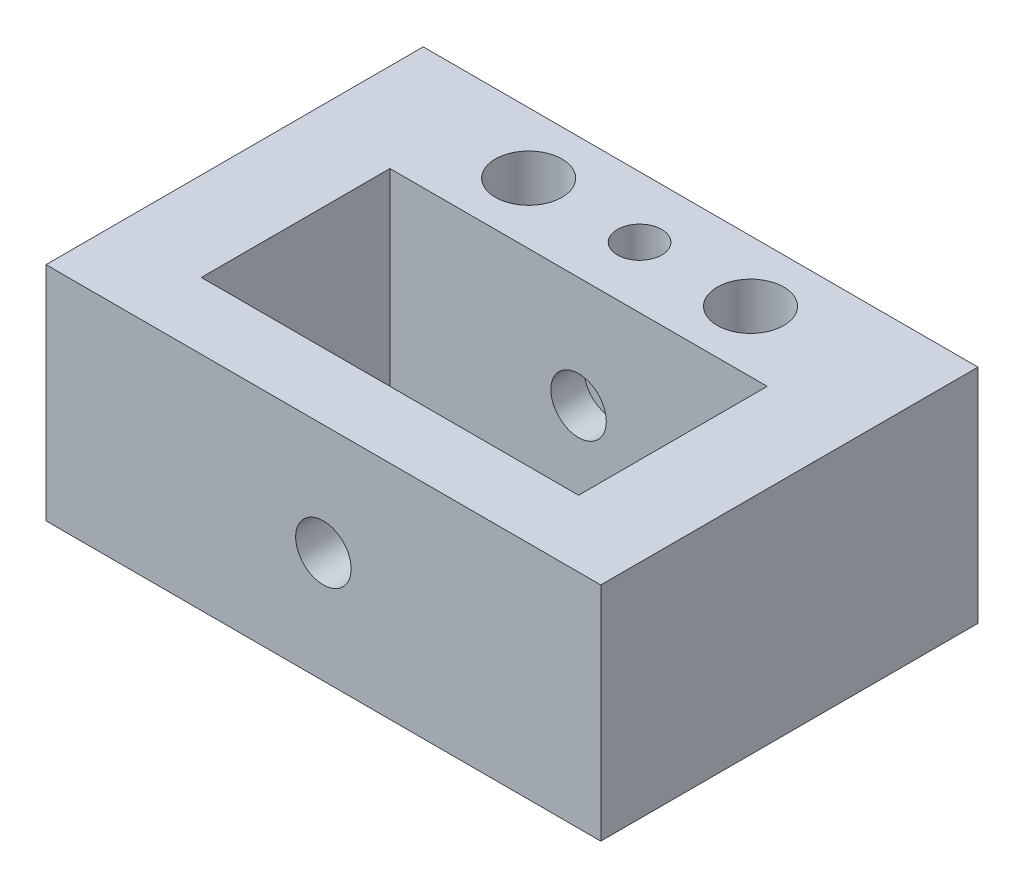
ISO-10303-21;
HEADER;
FILE_DESCRIPTION(('STEP AP214'),'2;1');
FILE_NAME('part.step','',(''),(''),'','','');
FILE_SCHEMA(('AUTOMOTIVE_DESIGN { 1 0 10303 214 1 1 1 1 }'));
ENDSEC;
DATA;
#1=APPLICATION_CONTEXT('core data for automotive mechanical design processes');
#2=APPLICATION_PROTOCOL_DEFINITION('international standard','automotive_design',2000,#1);
#3=PRODUCT_CONTEXT('',#1,'mechanical');
#4=PRODUCT('Part','Part','',(#3));
#5=PRODUCT_RELATED_PRODUCT_CATEGORY('part','',(#4));
#6=PRODUCT_DEFINITION_FORMATION('','',#4);
#7=PRODUCT_DEFINITION_CONTEXT('part definition',#1,'design');
#8=PRODUCT_DEFINITION('design','',#6,#7);
#9=PRODUCT_DEFINITION_SHAPE('','',#8);
#10=(LENGTH_UNIT() NAMED_UNIT(*) SI_UNIT(.MILLI.,.METRE.));
#11=(NAMED_UNIT(*) PLANE_ANGLE_UNIT() SI_UNIT($,.RADIAN.));
#12=(NAMED_UNIT(*) SI_UNIT($,.STERADIAN.) SOLID_ANGLE_UNIT());
#13=UNCERTAINTY_MEASURE_WITH_UNIT(LENGTH_MEASURE(1.E-05),#10,'distance_accuracy_value','');
#14=(GEOMETRIC_REPRESENTATION_CONTEXT(3) GLOBAL_UNCERTAINTY_ASSIGNED_CONTEXT((#13)) GLOBAL_UNIT_ASSIGNED_CONTEXT((#10,
#11,#12)) REPRESENTATION_CONTEXT('',''));
#15=CARTESIAN_POINT('',(0.,0.,0.));
#16=DIRECTION('',(0.,0.,1.));
#17=DIRECTION('',(1.,0.,0.));
#18=AXIS2_PLACEMENT_3D('',#15,#16,#17);
#19=CARTESIAN_POINT('',(17.,10.,33.));
#20=DIRECTION('',(1.,0.,0.));
#21=DIRECTION('',(0.,0.,-1.));
#22=AXIS2_PLACEMENT_3D('',#19,#20,#21);
#23=PLANE('',#22);
#24=DIRECTION('',(0.,-1.,0.));
#25=VECTOR('',#24,1.);
#26=CARTESIAN_POINT('',(17.,10.,28.));
#27=LINE('',#26,#25);
#28=CARTESIAN_POINT('',(17.,10.,28.));
#29=VERTEX_POINT('',#28);
#30=CARTESIAN_POINT('',(17.,-10.,28.));
#31=VERTEX_POINT('',#30);
#32=EDGE_CURVE('E55',#29,#31,#27,.T.);
#33=ORIENTED_EDGE('',*,*,#32,.F.);
#34=DIRECTION('',(0.,0.,-1.));
#35=VECTOR('',#34,1.);
#36=CARTESIAN_POINT('',(17.,10.,33.));
#37=LINE('',#36,#35);
#38=CARTESIAN_POINT('',(17.,10.,11.));
#39=VERTEX_POINT('',#38);
#40=EDGE_CURVE('E167',#29,#39,#37,.T.);
#41=ORIENTED_EDGE('',*,*,#40,.T.);
#42=DIRECTION('',(0.,-1.,0.));
#43=VECTOR('',#42,1.);
#44=CARTESIAN_POINT('',(17.,10.,11.));
#45=LINE('',#44,#43);
#46=CARTESIAN_POINT('',(17.,-10.,11.));
#47=VERTEX_POINT('',#46);
#48=EDGE_CURVE('E160',#39,#47,#45,.T.);
#49=ORIENTED_EDGE('',*,*,#48,.T.);
#50=DIRECTION('',(0.,0.,-1.));
#51=VECTOR('',#50,1.);
#52=CARTESIAN_POINT('',(17.,-10.,33.));
#53=LINE('',#52,#51);
#54=EDGE_CURVE('E164',#31,#47,#53,.T.);
#55=ORIENTED_EDGE('',*,*,#54,.F.);
#56=EDGE_LOOP('',(#33,#41,#49,#55));
#57=FACE_BOUND('',#56,.T.);
#58=ADVANCED_FACE('F39',(#57),#23,.F.);
#59=CARTESIAN_POINT('',(-17.,10.,33.));
#60=DIRECTION('',(-1.,0.,0.));
#61=DIRECTION('',(0.,0.,1.));
#62=AXIS2_PLACEMENT_3D('',#59,#60,#61);
#63=PLANE('',#62);
#64=DIRECTION('',(0.,1.,0.));
#65=VECTOR('',#64,1.);
#66=CARTESIAN_POINT('',(-17.,10.,28.));
#67=LINE('',#66,#65);
#68=CARTESIAN_POINT('',(-17.,-10.,28.));
#69=VERTEX_POINT('',#68);
#70=CARTESIAN_POINT('',(-17.,10.,28.));
#71=VERTEX_POINT('',#70);
#72=EDGE_CURVE('E11',#69,#71,#67,.T.);
#73=ORIENTED_EDGE('',*,*,#72,.F.);
#74=DIRECTION('',(0.,0.,-1.));
#75=VECTOR('',#74,1.);
#76=CARTESIAN_POINT('',(-17.,-10.,33.));
#77=LINE('',#76,#75);
#78=CARTESIAN_POINT('',(-17.,-10.,11.));
#79=VERTEX_POINT('',#78);
#80=EDGE_CURVE('E157',#69,#79,#77,.T.);
#81=ORIENTED_EDGE('',*,*,#80,.T.);
#82=DIRECTION('',(0.,1.,0.));
#83=VECTOR('',#82,1.);
#84=CARTESIAN_POINT('',(-17.,10.,11.));
#85=LINE('',#84,#83);
#86=CARTESIAN_POINT('',(-17.,10.,11.));
#87=VERTEX_POINT('',#86);
#88=EDGE_CURVE('E147',#79,#87,#85,.T.);
#89=ORIENTED_EDGE('',*,*,#88,.T.);
#90=DIRECTION('',(0.,0.,-1.));
#91=VECTOR('',#90,1.);
#92=CARTESIAN_POINT('',(-17.,10.,33.));
#93=LINE('',#92,#91);
#94=EDGE_CURVE('E154',#71,#87,#93,.T.);
#95=ORIENTED_EDGE('',*,*,#94,.F.);
#96=EDGE_LOOP('',(#73,#81,#89,#95));
#97=FACE_BOUND('',#96,.T.);
#98=ADVANCED_FACE('F266',(#97),#63,.F.);
#99=CARTESIAN_POINT('',(0.,0.,11.));
#100=DIRECTION('',(0.,0.,-1.));
#101=DIRECTION('',(-1.,0.,0.));
#102=AXIS2_PLACEMENT_3D('',#99,#100,#101);
#103=PLANE('',#102);
#104=CARTESIAN_POINT('',(0.,0.,11.));
#105=DIRECTION('',(0.,0.,1.));
#106=DIRECTION('',(1.,0.,0.));
#107=AXIS2_PLACEMENT_3D('',#104,#105,#106);
#108=CIRCLE('',#107,2.5);
#109=CARTESIAN_POINT('',(2.5,0.,11.));
#110=VERTEX_POINT('',#109);
#111=EDGE_CURVE('E142',#110,#110,#108,.T.);
#112=ORIENTED_EDGE('',*,*,#111,.F.);
#113=EDGE_LOOP('',(#112));
#114=FACE_BOUND('',#113,.T.);
#115=ORIENTED_EDGE('',*,*,#88,.F.);
#116=DIRECTION('',(1.,0.,0.));
#117=VECTOR('',#116,1.);
#118=CARTESIAN_POINT('',(-25.,-10.,11.));
#119=LINE('',#118,#117);
#120=EDGE_CURVE('E206',#79,#47,#119,.T.);
#121=ORIENTED_EDGE('',*,*,#120,.T.);
#122=ORIENTED_EDGE('',*,*,#48,.F.);
#123=DIRECTION('',(-1.,0.,0.));
#124=VECTOR('',#123,1.);
#125=CARTESIAN_POINT('',(-25.,10.,11.));
#126=LINE('',#125,#124);
#127=EDGE_CURVE('E202',#39,#87,#126,.T.);
#128=ORIENTED_EDGE('',*,*,#127,.T.);
#129=EDGE_LOOP('',(#115,#121,#122,#128));
#130=FACE_BOUND('',#129,.T.);
#131=ADVANCED_FACE('F271',(#114,#130),#103,.F.);
#132=CARTESIAN_POINT('',(25.,-10.,11.));
#133=DIRECTION('',(-1.,0.,0.));
#134=DIRECTION('',(0.,0.,1.));
#135=AXIS2_PLACEMENT_3D('',#132,#133,#134);
#136=PLANE('',#135);
#137=DIRECTION('',(0.,0.,-1.));
#138=VECTOR('',#137,1.);
#139=CARTESIAN_POINT('',(25.,-10.,11.));
#140=LINE('',#139,#138);
#141=CARTESIAN_POINT('',(25.,-10.,34.));
#142=VERTEX_POINT('',#141);
#143=CARTESIAN_POINT('',(25.,-10.,0.));
#144=VERTEX_POINT('',#143);
#145=EDGE_CURVE('E211',#142,#144,#140,.T.);
#146=ORIENTED_EDGE('',*,*,#145,.T.);
#147=DIRECTION('',(0.,1.,0.));
#148=VECTOR('',#147,1.);
#149=CARTESIAN_POINT('',(25.,-10.,0.));
#150=LINE('',#149,#148);
#151=CARTESIAN_POINT('',(25.,10.,0.));
#152=VERTEX_POINT('',#151);
#153=EDGE_CURVE('E107',#144,#152,#150,.T.);
#154=ORIENTED_EDGE('',*,*,#153,.T.);
#155=DIRECTION('',(0.,0.,-1.));
#156=VECTOR('',#155,1.);
#157=CARTESIAN_POINT('',(25.,10.,11.));
#158=LINE('',#157,#156);
#159=CARTESIAN_POINT('',(25.,10.,34.));
#160=VERTEX_POINT('',#159);
#161=EDGE_CURVE('E48',#160,#152,#158,.T.);
#162=ORIENTED_EDGE('',*,*,#161,.F.);
#163=DIRECTION('',(0.,1.,0.));
#164=VECTOR('',#163,1.);
#165=CARTESIAN_POINT('',(25.,-10.,34.));
#166=LINE('',#165,#164);
#167=EDGE_CURVE('E105',#142,#160,#166,.T.);
#168=ORIENTED_EDGE('',*,*,#167,.F.);
#169=EDGE_LOOP('',(#146,#154,#162,#168));
#170=FACE_BOUND('',#169,.T.);
#171=ADVANCED_FACE('F41',(#170),#136,.F.);
#172=CARTESIAN_POINT('',(-25.,10.,11.));
#173=DIRECTION('',(0.,-1.,0.));
#174=DIRECTION('',(0.,0.,-1.));
#175=AXIS2_PLACEMENT_3D('',#172,#173,#174);
#176=PLANE('',#175);
#177=ORIENTED_EDGE('',*,*,#40,.F.);
#178=DIRECTION('',(-1.,0.,0.));
#179=VECTOR('',#178,1.);
#180=CARTESIAN_POINT('',(25.,10.,28.));
#181=LINE('',#180,#179);
#182=EDGE_CURVE('E132',#29,#71,#181,.T.);
#183=ORIENTED_EDGE('',*,*,#182,.T.);
#184=ORIENTED_EDGE('',*,*,#94,.T.);
#185=ORIENTED_EDGE('',*,*,#127,.F.);
#186=EDGE_LOOP('',(#177,#183,#184,#185));
#187=FACE_BOUND('',#186,.T.);
#188=ORIENTED_EDGE('',*,*,#161,.T.);
#189=DIRECTION('',(-1.,0.,0.));
#190=VECTOR('',#189,1.);
#191=CARTESIAN_POINT('',(-25.,10.,0.));
#192=LINE('',#191,#190);
#193=CARTESIAN_POINT('',(-25.,10.,0.));
#194=VERTEX_POINT('',#193);
#195=EDGE_CURVE('E214',#152,#194,#192,.T.);
#196=ORIENTED_EDGE('',*,*,#195,.T.);
#197=DIRECTION('',(0.,0.,-1.));
#198=VECTOR('',#197,1.);
#199=CARTESIAN_POINT('',(-25.,10.,11.));
#200=LINE('',#199,#198);
#201=CARTESIAN_POINT('',(-25.,10.,34.));
#202=VERTEX_POINT('',#201);
#203=EDGE_CURVE('E112',#202,#194,#200,.T.);
#204=ORIENTED_EDGE('',*,*,#203,.F.);
#205=DIRECTION('',(-1.,0.,0.));
#206=VECTOR('',#205,1.);
#207=CARTESIAN_POINT('',(25.,10.,34.));
#208=LINE('',#207,#206);
#209=EDGE_CURVE('E114',#160,#202,#208,.T.);
#210=ORIENTED_EDGE('',*,*,#209,.F.);
#211=EDGE_LOOP('',(#188,#196,#204,#210));
#212=FACE_BOUND('',#211,.T.);
#213=CARTESIAN_POINT('',(-10.,10.,5.5));
#214=DIRECTION('',(0.,-1.,0.));
#215=DIRECTION('',(0.,0.,-1.));
#216=AXIS2_PLACEMENT_3D('',#213,#214,#215);
#217=CIRCLE('',#216,3.);
#218=CARTESIAN_POINT('',(-10.,10.,2.5));
#219=VERTEX_POINT('',#218);
#220=EDGE_CURVE('E171',#219,#219,#217,.T.);
#221=ORIENTED_EDGE('',*,*,#220,.T.);
#222=EDGE_LOOP('',(#221));
#223=FACE_BOUND('',#222,.T.);
#224=CARTESIAN_POINT('',(10.,10.,5.49999999999998));
#225=DIRECTION('',(0.,-1.,0.));
#226=DIRECTION('',(0.,0.,1.));
#227=AXIS2_PLACEMENT_3D('',#224,#225,#226);
#228=CIRCLE('',#227,3.);
#229=CARTESIAN_POINT('',(10.,10.,8.49999999999998));
#230=VERTEX_POINT('',#229);
#231=EDGE_CURVE('E180',#230,#230,#228,.T.);
#232=ORIENTED_EDGE('',*,*,#231,.T.);
#233=EDGE_LOOP('',(#232));
#234=FACE_BOUND('',#233,.T.);
#235=CARTESIAN_POINT('',(0.,10.,5.5));
#236=DIRECTION('',(0.,-1.,0.));
#237=DIRECTION('',(0.,0.,-1.));
#238=AXIS2_PLACEMENT_3D('',#235,#236,#237);
#239=CIRCLE('',#238,2.);
#240=CARTESIAN_POINT('',(0.,10.,3.5));
#241=VERTEX_POINT('',#240);
#242=EDGE_CURVE('E187',#241,#241,#239,.T.);
#243=ORIENTED_EDGE('',*,*,#242,.T.);
#244=EDGE_LOOP('',(#243));
#245=FACE_BOUND('',#244,.T.);
#246=ADVANCED_FACE('F115',(#187,#212,#223,#234,#245),#176,.F.);
#247=CARTESIAN_POINT('',(-25.,-10.,11.));
#248=DIRECTION('',(1.,0.,0.));
#249=DIRECTION('',(0.,0.,-1.));
#250=AXIS2_PLACEMENT_3D('',#247,#248,#249);
#251=PLANE('',#250);
#252=ORIENTED_EDGE('',*,*,#203,.T.);
#253=DIRECTION('',(0.,-1.,0.));
#254=VECTOR('',#253,1.);
#255=CARTESIAN_POINT('',(-25.,-10.,0.));
#256=LINE('',#255,#254);
#257=CARTESIAN_POINT('',(-25.,-10.,0.));
#258=VERTEX_POINT('',#257);
#259=EDGE_CURVE('E217',#194,#258,#256,.T.);
#260=ORIENTED_EDGE('',*,*,#259,.T.);
#261=DIRECTION('',(0.,0.,-1.));
#262=VECTOR('',#261,1.);
#263=CARTESIAN_POINT('',(-25.,-10.,11.));
#264=LINE('',#263,#262);
#265=CARTESIAN_POINT('',(-25.,-10.,34.));
#266=VERTEX_POINT('',#265);
#267=EDGE_CURVE('E226',#266,#258,#264,.T.);
#268=ORIENTED_EDGE('',*,*,#267,.F.);
#269=DIRECTION('',(0.,-1.,0.));
#270=VECTOR('',#269,1.);
#271=CARTESIAN_POINT('',(-25.,10.,34.));
#272=LINE('',#271,#270);
#273=EDGE_CURVE('E121',#202,#266,#272,.T.);
#274=ORIENTED_EDGE('',*,*,#273,.F.);
#275=EDGE_LOOP('',(#252,#260,#268,#274));
#276=FACE_BOUND('',#275,.T.);
#277=ADVANCED_FACE('F231',(#276),#251,.F.);
#278=CARTESIAN_POINT('',(-25.,-10.,11.));
#279=DIRECTION('',(0.,1.,0.));
#280=DIRECTION('',(0.,0.,1.));
#281=AXIS2_PLACEMENT_3D('',#278,#279,#280);
#282=PLANE('',#281);
#283=ORIENTED_EDGE('',*,*,#80,.F.);
#284=DIRECTION('',(1.,0.,0.));
#285=VECTOR('',#284,1.);
#286=CARTESIAN_POINT('',(-25.,-10.,28.));
#287=LINE('',#286,#285);
#288=EDGE_CURVE('E128',#69,#31,#287,.T.);
#289=ORIENTED_EDGE('',*,*,#288,.T.);
#290=ORIENTED_EDGE('',*,*,#54,.T.);
#291=ORIENTED_EDGE('',*,*,#120,.F.);
#292=EDGE_LOOP('',(#283,#289,#290,#291));
#293=FACE_BOUND('',#292,.T.);
#294=ORIENTED_EDGE('',*,*,#145,.F.);
#295=DIRECTION('',(1.,0.,0.));
#296=VECTOR('',#295,1.);
#297=CARTESIAN_POINT('',(-25.,-10.,34.));
#298=LINE('',#297,#296);
#299=EDGE_CURVE('E126',#266,#142,#298,.T.);
#300=ORIENTED_EDGE('',*,*,#299,.F.);
#301=ORIENTED_EDGE('',*,*,#267,.T.);
#302=DIRECTION('',(1.,0.,0.));
#303=VECTOR('',#302,1.);
#304=CARTESIAN_POINT('',(-25.,-10.,0.));
#305=LINE('',#304,#303);
#306=EDGE_CURVE('E207',#258,#144,#305,.T.);
#307=ORIENTED_EDGE('',*,*,#306,.T.);
#308=EDGE_LOOP('',(#294,#300,#301,#307));
#309=FACE_BOUND('',#308,.T.);
#310=CARTESIAN_POINT('',(-10.,-10.,5.5));
#311=DIRECTION('',(0.,-1.,0.));
#312=DIRECTION('',(0.,0.,-1.));
#313=AXIS2_PLACEMENT_3D('',#310,#311,#312);
#314=CIRCLE('',#313,3.);
#315=CARTESIAN_POINT('',(-10.,-10.,2.5));
#316=VERTEX_POINT('',#315);
#317=EDGE_CURVE('E176',#316,#316,#314,.T.);
#318=ORIENTED_EDGE('',*,*,#317,.F.);
#319=EDGE_LOOP('',(#318));
#320=FACE_BOUND('',#319,.T.);
#321=CARTESIAN_POINT('',(10.,-10.,5.49999999999998));
#322=DIRECTION('',(0.,-1.,0.));
#323=DIRECTION('',(0.,0.,1.));
#324=AXIS2_PLACEMENT_3D('',#321,#322,#323);
#325=CIRCLE('',#324,3.);
#326=CARTESIAN_POINT('',(10.,-10.,8.49999999999998));
#327=VERTEX_POINT('',#326);
#328=EDGE_CURVE('E170',#327,#327,#325,.T.);
#329=ORIENTED_EDGE('',*,*,#328,.F.);
#330=EDGE_LOOP('',(#329));
#331=FACE_BOUND('',#330,.T.);
#332=CARTESIAN_POINT('',(0.,-10.,5.5));
#333=DIRECTION('',(0.,-1.,0.));
#334=DIRECTION('',(0.,0.,-1.));
#335=AXIS2_PLACEMENT_3D('',#332,#333,#334);
#336=CIRCLE('',#335,2.);
#337=CARTESIAN_POINT('',(0.,-10.,3.5));
#338=VERTEX_POINT('',#337);
#339=EDGE_CURVE('E175',#338,#338,#336,.T.);
#340=ORIENTED_EDGE('',*,*,#339,.F.);
#341=EDGE_LOOP('',(#340));
#342=FACE_BOUND('',#341,.T.);
#343=ADVANCED_FACE('F237',(#293,#309,#320,#331,#342),#282,.F.);
#344=CARTESIAN_POINT('',(0.,0.,0.));
#345=DIRECTION('',(0.,0.,-1.));
#346=DIRECTION('',(-1.,0.,0.));
#347=AXIS2_PLACEMENT_3D('',#344,#345,#346);
#348=PLANE('',#347);
#349=CARTESIAN_POINT('',(20.,0.,0.));
#350=DIRECTION('',(0.,0.,-1.));
#351=DIRECTION('',(-1.,0.,0.));
#352=AXIS2_PLACEMENT_3D('',#349,#350,#351);
#353=CIRCLE('',#352,2.);
#354=CARTESIAN_POINT('',(18.,0.,0.));
#355=VERTEX_POINT('',#354);
#356=EDGE_CURVE('E195',#355,#355,#353,.T.);
#357=ORIENTED_EDGE('',*,*,#356,.F.);
#358=EDGE_LOOP('',(#357));
#359=FACE_BOUND('',#358,.T.);
#360=CARTESIAN_POINT('',(-20.,0.,0.));
#361=DIRECTION('',(0.,0.,-1.));
#362=DIRECTION('',(-1.,0.,0.));
#363=AXIS2_PLACEMENT_3D('',#360,#361,#362);
#364=CIRCLE('',#363,2.);
#365=CARTESIAN_POINT('',(-22.,0.,0.));
#366=VERTEX_POINT('',#365);
#367=EDGE_CURVE('E191',#366,#366,#364,.T.);
#368=ORIENTED_EDGE('',*,*,#367,.F.);
#369=EDGE_LOOP('',(#368));
#370=FACE_BOUND('',#369,.T.);
#371=ORIENTED_EDGE('',*,*,#153,.F.);
#372=ORIENTED_EDGE('',*,*,#306,.F.);
#373=ORIENTED_EDGE('',*,*,#259,.F.);
#374=ORIENTED_EDGE('',*,*,#195,.F.);
#375=EDGE_LOOP('',(#371,#372,#373,#374));
#376=FACE_BOUND('',#375,.T.);
#377=ADVANCED_FACE('F235',(#359,#370,#376),#348,.T.);
#378=CARTESIAN_POINT('',(-20.,0.,16.6568542494924));
#379=DIRECTION('',(0.,0.,-1.));
#380=DIRECTION('',(-1.,0.,0.));
#381=AXIS2_PLACEMENT_3D('',#378,#379,#380);
#382=CYLINDRICAL_SURFACE('',#381,2.);
#383=ORIENTED_EDGE('',*,*,#367,.T.);
#384=EDGE_LOOP('',(#383));
#385=FACE_BOUND('',#384,.T.);
#386=CARTESIAN_POINT('',(-20.,0.,24.));
#387=DIRECTION('',(0.,0.,-1.));
#388=DIRECTION('',(-1.,0.,0.));
#389=AXIS2_PLACEMENT_3D('',#386,#387,#388);
#390=CIRCLE('',#389,2.);
#391=CARTESIAN_POINT('',(-22.,0.,24.));
#392=VERTEX_POINT('',#391);
#393=EDGE_CURVE('E311',#392,#392,#390,.T.);
#394=ORIENTED_EDGE('',*,*,#393,.F.);
#395=EDGE_LOOP('',(#394));
#396=FACE_BOUND('',#395,.T.);
#397=ADVANCED_FACE('F261',(#385,#396),#382,.F.);
#398=CARTESIAN_POINT('',(20.,0.,16.6568542494924));
#399=DIRECTION('',(0.,0.,-1.));
#400=DIRECTION('',(-1.,0.,0.));
#401=AXIS2_PLACEMENT_3D('',#398,#399,#400);
#402=CYLINDRICAL_SURFACE('',#401,2.);
#403=ORIENTED_EDGE('',*,*,#356,.T.);
#404=EDGE_LOOP('',(#403));
#405=FACE_BOUND('',#404,.T.);
#406=CARTESIAN_POINT('',(20.,0.,24.));
#407=DIRECTION('',(0.,0.,-1.));
#408=DIRECTION('',(-1.,0.,0.));
#409=AXIS2_PLACEMENT_3D('',#406,#407,#408);
#410=CIRCLE('',#409,2.);
#411=CARTESIAN_POINT('',(18.,0.,24.));
#412=VERTEX_POINT('',#411);
#413=EDGE_CURVE('E314',#412,#412,#410,.T.);
#414=ORIENTED_EDGE('',*,*,#413,.F.);
#415=EDGE_LOOP('',(#414));
#416=FACE_BOUND('',#415,.T.);
#417=ADVANCED_FACE('F251',(#405,#416),#402,.F.);
#418=CARTESIAN_POINT('',(0.,10.,5.5));
#419=DIRECTION('',(0.,-1.,0.));
#420=DIRECTION('',(0.,0.,-1.));
#421=AXIS2_PLACEMENT_3D('',#418,#419,#420);
#422=CYLINDRICAL_SURFACE('',#421,2.);
#423=ORIENTED_EDGE('',*,*,#242,.F.);
#424=EDGE_LOOP('',(#423));
#425=FACE_BOUND('',#424,.T.);
#426=ORIENTED_EDGE('',*,*,#339,.T.);
#427=EDGE_LOOP('',(#426));
#428=FACE_BOUND('',#427,.T.);
#429=ADVANCED_FACE('F248',(#425,#428),#422,.F.);
#430=CARTESIAN_POINT('',(10.,10.,5.49999999999998));
#431=DIRECTION('',(0.,-1.,0.));
#432=DIRECTION('',(0.,0.,-1.));
#433=AXIS2_PLACEMENT_3D('',#430,#431,#432);
#434=CYLINDRICAL_SURFACE('',#433,3.);
#435=ORIENTED_EDGE('',*,*,#231,.F.);
#436=EDGE_LOOP('',(#435));
#437=FACE_BOUND('',#436,.T.);
#438=ORIENTED_EDGE('',*,*,#328,.T.);
#439=EDGE_LOOP('',(#438));
#440=FACE_BOUND('',#439,.T.);
#441=ADVANCED_FACE('F250',(#437,#440),#434,.F.);
#442=CARTESIAN_POINT('',(-10.,10.,5.5));
#443=DIRECTION('',(0.,-1.,0.));
#444=DIRECTION('',(0.,0.,-1.));
#445=AXIS2_PLACEMENT_3D('',#442,#443,#444);
#446=CYLINDRICAL_SURFACE('',#445,3.);
#447=ORIENTED_EDGE('',*,*,#220,.F.);
#448=EDGE_LOOP('',(#447));
#449=FACE_BOUND('',#448,.T.);
#450=ORIENTED_EDGE('',*,*,#317,.T.);
#451=EDGE_LOOP('',(#450));
#452=FACE_BOUND('',#451,.T.);
#453=ADVANCED_FACE('F258',(#449,#452),#446,.F.);
#454=CARTESIAN_POINT('',(0.,0.,8.));
#455=DIRECTION('',(0.,0.,1.));
#456=DIRECTION('',(1.,0.,0.));
#457=AXIS2_PLACEMENT_3D('',#454,#455,#456);
#458=CYLINDRICAL_SURFACE('',#457,2.5);
#459=CARTESIAN_POINT('',(0.,0.,8.));
#460=DIRECTION('',(0.,0.,1.));
#461=DIRECTION('',(1.,0.,0.));
#462=AXIS2_PLACEMENT_3D('',#459,#460,#461);
#463=CIRCLE('',#462,2.5);
#464=CARTESIAN_POINT('',(2.5,0.,8.));
#465=VERTEX_POINT('',#464);
#466=EDGE_CURVE('E143',#465,#465,#463,.T.);
#467=ORIENTED_EDGE('',*,*,#466,.F.);
#468=EDGE_LOOP('',(#467));
#469=FACE_BOUND('',#468,.T.);
#470=ORIENTED_EDGE('',*,*,#111,.T.);
#471=EDGE_LOOP('',(#470));
#472=FACE_BOUND('',#471,.T.);
#473=ADVANCED_FACE('F276',(#469,#472),#458,.F.);
#474=CARTESIAN_POINT('',(0.,0.,8.));
#475=DIRECTION('',(0.,0.,1.));
#476=DIRECTION('',(1.,0.,0.));
#477=AXIS2_PLACEMENT_3D('',#474,#475,#476);
#478=PLANE('',#477);
#479=ORIENTED_EDGE('',*,*,#466,.T.);
#480=EDGE_LOOP('',(#479));
#481=FACE_BOUND('',#480,.T.);
#482=ADVANCED_FACE('F281',(#481),#478,.T.);
#483=CARTESIAN_POINT('',(0.,0.,28.));
#484=DIRECTION('',(0.,0.,1.));
#485=DIRECTION('',(1.,0.,0.));
#486=AXIS2_PLACEMENT_3D('',#483,#484,#485);
#487=PLANE('',#486);
#488=CARTESIAN_POINT('',(0.,0.,28.));
#489=DIRECTION('',(0.,0.,1.));
#490=DIRECTION('',(1.,0.,0.));
#491=AXIS2_PLACEMENT_3D('',#488,#489,#490);
#492=CIRCLE('',#491,2.5);
#493=CARTESIAN_POINT('',(2.5,0.,28.));
#494=VERTEX_POINT('',#493);
#495=EDGE_CURVE('E324',#494,#494,#492,.F.);
#496=ORIENTED_EDGE('',*,*,#495,.F.);
#497=EDGE_LOOP('',(#496));
#498=FACE_BOUND('',#497,.T.);
#499=ORIENTED_EDGE('',*,*,#182,.F.);
#500=ORIENTED_EDGE('',*,*,#32,.T.);
#501=ORIENTED_EDGE('',*,*,#288,.F.);
#502=ORIENTED_EDGE('',*,*,#72,.T.);
#503=EDGE_LOOP('',(#499,#500,#501,#502));
#504=FACE_BOUND('',#503,.T.);
#505=ADVANCED_FACE('F332',(#498,#504),#487,.F.);
#506=CARTESIAN_POINT('',(0.,0.,34.));
#507=DIRECTION('',(0.,0.,1.));
#508=DIRECTION('',(1.,0.,0.));
#509=AXIS2_PLACEMENT_3D('',#506,#507,#508);
#510=PLANE('',#509);
#511=CARTESIAN_POINT('',(0.,0.,34.));
#512=DIRECTION('',(0.,0.,1.));
#513=DIRECTION('',(1.,0.,0.));
#514=AXIS2_PLACEMENT_3D('',#511,#512,#513);
#515=CIRCLE('',#514,2.5);
#516=CARTESIAN_POINT('',(2.5,0.,34.));
#517=VERTEX_POINT('',#516);
#518=EDGE_CURVE('E318',#517,#517,#515,.T.);
#519=ORIENTED_EDGE('',*,*,#518,.F.);
#520=EDGE_LOOP('',(#519));
#521=FACE_BOUND('',#520,.T.);
#522=ORIENTED_EDGE('',*,*,#167,.T.);
#523=ORIENTED_EDGE('',*,*,#209,.T.);
#524=ORIENTED_EDGE('',*,*,#273,.T.);
#525=ORIENTED_EDGE('',*,*,#299,.T.);
#526=EDGE_LOOP('',(#522,#523,#524,#525));
#527=FACE_BOUND('',#526,.T.);
#528=ADVANCED_FACE('F124',(#521,#527),#510,.T.);
#529=CARTESIAN_POINT('',(0.,0.,20.9289321881345));
#530=DIRECTION('',(0.,0.,1.));
#531=DIRECTION('',(1.,0.,0.));
#532=AXIS2_PLACEMENT_3D('',#529,#530,#531);
#533=CYLINDRICAL_SURFACE('',#532,2.5);
#534=ORIENTED_EDGE('',*,*,#495,.T.);
#535=EDGE_LOOP('',(#534));
#536=FACE_BOUND('',#535,.T.);
#537=ORIENTED_EDGE('',*,*,#518,.T.);
#538=EDGE_LOOP('',(#537));
#539=FACE_BOUND('',#538,.T.);
#540=ADVANCED_FACE('F345',(#536,#539),#533,.F.);
#541=CARTESIAN_POINT('',(-20.,0.,24.));
#542=DIRECTION('',(0.,0.,-1.));
#543=DIRECTION('',(-1.,0.,0.));
#544=AXIS2_PLACEMENT_3D('',#541,#542,#543);
#545=PLANE('',#544);
#546=ORIENTED_EDGE('',*,*,#393,.T.);
#547=EDGE_LOOP('',(#546));
#548=FACE_BOUND('',#547,.T.);
#549=ADVANCED_FACE('F354',(#548),#545,.T.);
#550=CARTESIAN_POINT('',(20.,0.,24.));
#551=DIRECTION('',(0.,0.,-1.));
#552=DIRECTION('',(-1.,0.,0.));
#553=AXIS2_PLACEMENT_3D('',#550,#551,#552);
#554=PLANE('',#553);
#555=ORIENTED_EDGE('',*,*,#413,.T.);
#556=EDGE_LOOP('',(#555));
#557=FACE_BOUND('',#556,.T.);
#558=ADVANCED_FACE('F358',(#557),#554,.T.);
#559=CLOSED_SHELL('',(#58,#98,#131,#171,#246,#277,#343,#377,#397,#417,#429,#441,#453,#473,#482,
#505,#528,#540,#549,#558));
#560=MANIFOLD_SOLID_BREP('B2',#559);
#561=ADVANCED_BREP_SHAPE_REPRESENTATION('',(#18,#560),#14);
#562=SHAPE_DEFINITION_REPRESENTATION(#9,#561);
ENDSEC;
END-ISO-10303-21;
